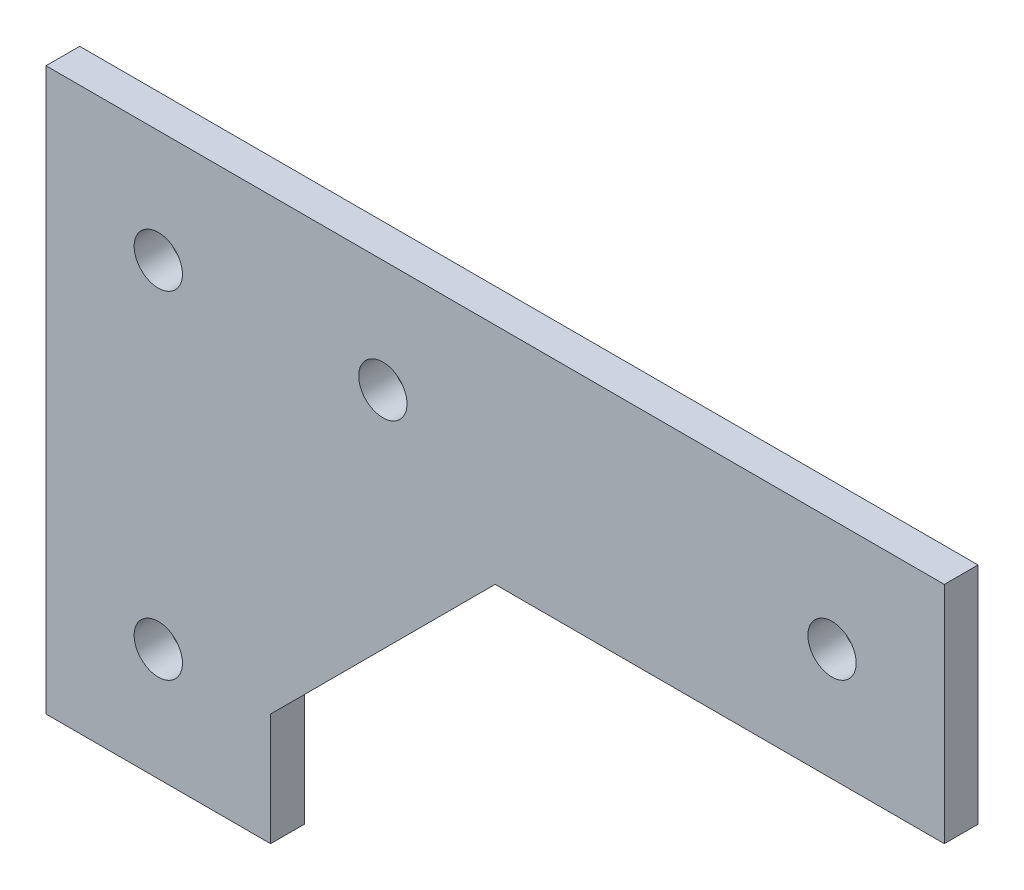
ISO-10303-21;
HEADER;
FILE_DESCRIPTION(('STEP AP214'),'2;1');
FILE_NAME('part.step','',(''),(''),'','','');
FILE_SCHEMA(('AUTOMOTIVE_DESIGN { 1 0 10303 214 1 1 1 1 }'));
ENDSEC;
DATA;
#1=APPLICATION_CONTEXT('core data for automotive mechanical design processes');
#2=APPLICATION_PROTOCOL_DEFINITION('international standard','automotive_design',2000,#1);
#3=PRODUCT_CONTEXT('',#1,'mechanical');
#4=PRODUCT('Part','Part','',(#3));
#5=PRODUCT_RELATED_PRODUCT_CATEGORY('part','',(#4));
#6=PRODUCT_DEFINITION_FORMATION('','',#4);
#7=PRODUCT_DEFINITION_CONTEXT('part definition',#1,'design');
#8=PRODUCT_DEFINITION('design','',#6,#7);
#9=PRODUCT_DEFINITION_SHAPE('','',#8);
#10=(LENGTH_UNIT() NAMED_UNIT(*) SI_UNIT(.MILLI.,.METRE.));
#11=(NAMED_UNIT(*) PLANE_ANGLE_UNIT() SI_UNIT($,.RADIAN.));
#12=(NAMED_UNIT(*) SI_UNIT($,.STERADIAN.) SOLID_ANGLE_UNIT());
#13=UNCERTAINTY_MEASURE_WITH_UNIT(LENGTH_MEASURE(1.E-05),#10,'distance_accuracy_value','');
#14=(GEOMETRIC_REPRESENTATION_CONTEXT(3) GLOBAL_UNCERTAINTY_ASSIGNED_CONTEXT((#13)) GLOBAL_UNIT_ASSIGNED_CONTEXT((#10,
#11,#12)) REPRESENTATION_CONTEXT('',''));
#15=CARTESIAN_POINT('',(0.,0.,0.));
#16=DIRECTION('',(0.,0.,1.));
#17=DIRECTION('',(1.,0.,0.));
#18=AXIS2_PLACEMENT_3D('',#15,#16,#17);
#19=CARTESIAN_POINT('',(0.,0.,3.));
#20=DIRECTION('',(0.,0.,1.));
#21=DIRECTION('',(1.,0.,0.));
#22=AXIS2_PLACEMENT_3D('',#19,#20,#21);
#23=PLANE('',#22);
#24=CARTESIAN_POINT('',(-17.5029517864278,125.,3.));
#25=DIRECTION('',(0.,0.,1.));
#26=DIRECTION('',(1.,0.,0.));
#27=AXIS2_PLACEMENT_3D('',#24,#25,#26);
#28=CIRCLE('',#27,2.15);
#29=CARTESIAN_POINT('',(-15.3529517864278,125.,3.));
#30=VERTEX_POINT('',#29);
#31=EDGE_CURVE('E172',#30,#30,#28,.T.);
#32=ORIENTED_EDGE('',*,*,#31,.F.);
#33=EDGE_LOOP('',(#32));
#34=FACE_BOUND('',#33,.T.);
#35=CARTESIAN_POINT('',(2.49704821357221,155.,3.));
#36=DIRECTION('',(0.,0.,1.));
#37=DIRECTION('',(1.,0.,0.));
#38=AXIS2_PLACEMENT_3D('',#35,#36,#37);
#39=CIRCLE('',#38,2.15000000000001);
#40=CARTESIAN_POINT('',(4.64704821357221,155.,3.));
#41=VERTEX_POINT('',#40);
#42=EDGE_CURVE('E130',#41,#41,#39,.T.);
#43=ORIENTED_EDGE('',*,*,#42,.F.);
#44=EDGE_LOOP('',(#43));
#45=FACE_BOUND('',#44,.T.);
#46=DIRECTION('',(0.,1.,0.));
#47=VECTOR('',#46,1.);
#48=CARTESIAN_POINT('',(52.4970482135722,145.,3.));
#49=LINE('',#48,#47);
#50=CARTESIAN_POINT('',(52.4970482135722,145.,3.));
#51=VERTEX_POINT('',#50);
#52=CARTESIAN_POINT('',(52.4970482135722,165.,3.));
#53=VERTEX_POINT('',#52);
#54=EDGE_CURVE('E139',#51,#53,#49,.T.);
#55=ORIENTED_EDGE('',*,*,#54,.T.);
#56=DIRECTION('',(-1.,0.,0.));
#57=VECTOR('',#56,1.);
#58=CARTESIAN_POINT('',(52.4970482135722,165.,3.));
#59=LINE('',#58,#57);
#60=CARTESIAN_POINT('',(-27.5029517864278,165.,3.));
#61=VERTEX_POINT('',#60);
#62=EDGE_CURVE('E92',#53,#61,#59,.T.);
#63=ORIENTED_EDGE('',*,*,#62,.T.);
#64=DIRECTION('',(0.,-1.,0.));
#65=VECTOR('',#64,1.);
#66=CARTESIAN_POINT('',(-27.5029517864278,165.,3.));
#67=LINE('',#66,#65);
#68=CARTESIAN_POINT('',(-27.5029517864279,115.,3.));
#69=VERTEX_POINT('',#68);
#70=EDGE_CURVE('E151',#61,#69,#67,.T.);
#71=ORIENTED_EDGE('',*,*,#70,.T.);
#72=DIRECTION('',(1.,0.,0.));
#73=VECTOR('',#72,1.);
#74=CARTESIAN_POINT('',(-27.5029517864279,115.,3.));
#75=LINE('',#74,#73);
#76=CARTESIAN_POINT('',(-7.50295178642777,115.,3.));
#77=VERTEX_POINT('',#76);
#78=EDGE_CURVE('E108',#69,#77,#75,.T.);
#79=ORIENTED_EDGE('',*,*,#78,.T.);
#80=DIRECTION('',(0.,1.,0.));
#81=VECTOR('',#80,1.);
#82=CARTESIAN_POINT('',(-7.50295178642777,115.,3.));
#83=LINE('',#82,#81);
#84=CARTESIAN_POINT('',(-7.50295178642779,125.,3.));
#85=VERTEX_POINT('',#84);
#86=EDGE_CURVE('E102',#77,#85,#83,.T.);
#87=ORIENTED_EDGE('',*,*,#86,.T.);
#88=DIRECTION('',(0.707106781186547,0.707106781186548,0.));
#89=VECTOR('',#88,1.);
#90=CARTESIAN_POINT('',(-7.50295178642779,125.,3.));
#91=LINE('',#90,#89);
#92=CARTESIAN_POINT('',(12.4970482135722,145.,3.));
#93=VERTEX_POINT('',#92);
#94=EDGE_CURVE('E106',#85,#93,#91,.T.);
#95=ORIENTED_EDGE('',*,*,#94,.T.);
#96=DIRECTION('',(1.,0.,0.));
#97=VECTOR('',#96,1.);
#98=CARTESIAN_POINT('',(12.4970482135722,145.,3.));
#99=LINE('',#98,#97);
#100=EDGE_CURVE('E52',#93,#51,#99,.T.);
#101=ORIENTED_EDGE('',*,*,#100,.T.);
#102=EDGE_LOOP('',(#55,#63,#71,#79,#87,#95,#101));
#103=FACE_BOUND('',#102,.T.);
#104=CARTESIAN_POINT('',(42.4970482135722,155.,3.));
#105=DIRECTION('',(0.,0.,1.));
#106=DIRECTION('',(1.,0.,0.));
#107=AXIS2_PLACEMENT_3D('',#104,#105,#106);
#108=CIRCLE('',#107,2.15000000000001);
#109=CARTESIAN_POINT('',(44.6470482135722,155.,3.));
#110=VERTEX_POINT('',#109);
#111=EDGE_CURVE('E166',#110,#110,#108,.T.);
#112=ORIENTED_EDGE('',*,*,#111,.F.);
#113=EDGE_LOOP('',(#112));
#114=FACE_BOUND('',#113,.T.);
#115=CARTESIAN_POINT('',(-17.5029517864278,155.,3.));
#116=DIRECTION('',(0.,0.,1.));
#117=DIRECTION('',(1.,0.,0.));
#118=AXIS2_PLACEMENT_3D('',#115,#116,#117);
#119=CIRCLE('',#118,2.15);
#120=CARTESIAN_POINT('',(-15.3529517864278,155.,3.));
#121=VERTEX_POINT('',#120);
#122=EDGE_CURVE('E178',#121,#121,#119,.T.);
#123=ORIENTED_EDGE('',*,*,#122,.F.);
#124=EDGE_LOOP('',(#123));
#125=FACE_BOUND('',#124,.T.);
#126=ADVANCED_FACE('F35',(#34,#45,#103,#114,#125),#23,.T.);
#127=CARTESIAN_POINT('',(0.,0.,0.));
#128=DIRECTION('',(0.,0.,1.));
#129=DIRECTION('',(1.,0.,0.));
#130=AXIS2_PLACEMENT_3D('',#127,#128,#129);
#131=PLANE('',#130);
#132=DIRECTION('',(0.,1.,0.));
#133=VECTOR('',#132,1.);
#134=CARTESIAN_POINT('',(52.4970482135722,145.,0.));
#135=LINE('',#134,#133);
#136=CARTESIAN_POINT('',(52.4970482135722,145.,0.));
#137=VERTEX_POINT('',#136);
#138=CARTESIAN_POINT('',(52.4970482135722,165.,0.));
#139=VERTEX_POINT('',#138);
#140=EDGE_CURVE('E126',#137,#139,#135,.T.);
#141=ORIENTED_EDGE('',*,*,#140,.F.);
#142=DIRECTION('',(1.,0.,0.));
#143=VECTOR('',#142,1.);
#144=CARTESIAN_POINT('',(12.4970482135722,145.,0.));
#145=LINE('',#144,#143);
#146=CARTESIAN_POINT('',(12.4970482135722,145.,0.));
#147=VERTEX_POINT('',#146);
#148=EDGE_CURVE('E84',#147,#137,#145,.T.);
#149=ORIENTED_EDGE('',*,*,#148,.F.);
#150=DIRECTION('',(0.707106781186547,0.707106781186548,0.));
#151=VECTOR('',#150,1.);
#152=CARTESIAN_POINT('',(-7.50295178642779,125.,0.));
#153=LINE('',#152,#151);
#154=CARTESIAN_POINT('',(-7.50295178642779,125.,0.));
#155=VERTEX_POINT('',#154);
#156=EDGE_CURVE('E78',#155,#147,#153,.T.);
#157=ORIENTED_EDGE('',*,*,#156,.F.);
#158=DIRECTION('',(0.,1.,0.));
#159=VECTOR('',#158,1.);
#160=CARTESIAN_POINT('',(-7.50295178642777,115.,0.));
#161=LINE('',#160,#159);
#162=CARTESIAN_POINT('',(-7.50295178642777,115.,0.));
#163=VERTEX_POINT('',#162);
#164=EDGE_CURVE('E116',#163,#155,#161,.T.);
#165=ORIENTED_EDGE('',*,*,#164,.F.);
#166=DIRECTION('',(1.,0.,0.));
#167=VECTOR('',#166,1.);
#168=CARTESIAN_POINT('',(-27.5029517864279,115.,0.));
#169=LINE('',#168,#167);
#170=CARTESIAN_POINT('',(-27.5029517864279,115.,0.));
#171=VERTEX_POINT('',#170);
#172=EDGE_CURVE('E134',#171,#163,#169,.T.);
#173=ORIENTED_EDGE('',*,*,#172,.F.);
#174=DIRECTION('',(0.,-1.,0.));
#175=VECTOR('',#174,1.);
#176=CARTESIAN_POINT('',(-27.5029517864278,165.,0.));
#177=LINE('',#176,#175);
#178=CARTESIAN_POINT('',(-27.5029517864278,165.,0.));
#179=VERTEX_POINT('',#178);
#180=EDGE_CURVE('E132',#179,#171,#177,.T.);
#181=ORIENTED_EDGE('',*,*,#180,.F.);
#182=DIRECTION('',(-1.,0.,0.));
#183=VECTOR('',#182,1.);
#184=CARTESIAN_POINT('',(52.4970482135722,165.,0.));
#185=LINE('',#184,#183);
#186=EDGE_CURVE('E129',#139,#179,#185,.T.);
#187=ORIENTED_EDGE('',*,*,#186,.F.);
#188=EDGE_LOOP('',(#141,#149,#157,#165,#173,#181,#187));
#189=FACE_BOUND('',#188,.T.);
#190=CARTESIAN_POINT('',(2.49704821357221,155.,0.));
#191=DIRECTION('',(0.,0.,1.));
#192=DIRECTION('',(1.,0.,0.));
#193=AXIS2_PLACEMENT_3D('',#190,#191,#192);
#194=CIRCLE('',#193,2.15000000000001);
#195=CARTESIAN_POINT('',(4.64704821357221,155.,0.));
#196=VERTEX_POINT('',#195);
#197=EDGE_CURVE('E163',#196,#196,#194,.T.);
#198=ORIENTED_EDGE('',*,*,#197,.T.);
#199=EDGE_LOOP('',(#198));
#200=FACE_BOUND('',#199,.T.);
#201=CARTESIAN_POINT('',(42.4970482135722,155.,0.));
#202=DIRECTION('',(0.,0.,1.));
#203=DIRECTION('',(1.,0.,0.));
#204=AXIS2_PLACEMENT_3D('',#201,#202,#203);
#205=CIRCLE('',#204,2.15000000000001);
#206=CARTESIAN_POINT('',(44.6470482135722,155.,0.));
#207=VERTEX_POINT('',#206);
#208=EDGE_CURVE('E169',#207,#207,#205,.T.);
#209=ORIENTED_EDGE('',*,*,#208,.T.);
#210=EDGE_LOOP('',(#209));
#211=FACE_BOUND('',#210,.T.);
#212=CARTESIAN_POINT('',(-17.5029517864278,125.,0.));
#213=DIRECTION('',(0.,0.,1.));
#214=DIRECTION('',(1.,0.,0.));
#215=AXIS2_PLACEMENT_3D('',#212,#213,#214);
#216=CIRCLE('',#215,2.15);
#217=CARTESIAN_POINT('',(-15.3529517864278,125.,0.));
#218=VERTEX_POINT('',#217);
#219=EDGE_CURVE('E175',#218,#218,#216,.T.);
#220=ORIENTED_EDGE('',*,*,#219,.T.);
#221=EDGE_LOOP('',(#220));
#222=FACE_BOUND('',#221,.T.);
#223=CARTESIAN_POINT('',(-17.5029517864278,155.,0.));
#224=DIRECTION('',(0.,0.,1.));
#225=DIRECTION('',(1.,0.,0.));
#226=AXIS2_PLACEMENT_3D('',#223,#224,#225);
#227=CIRCLE('',#226,2.15);
#228=CARTESIAN_POINT('',(-15.3529517864278,155.,0.));
#229=VERTEX_POINT('',#228);
#230=EDGE_CURVE('E181',#229,#229,#227,.T.);
#231=ORIENTED_EDGE('',*,*,#230,.T.);
#232=EDGE_LOOP('',(#231));
#233=FACE_BOUND('',#232,.T.);
#234=ADVANCED_FACE('F155',(#189,#200,#211,#222,#233),#131,.F.);
#235=CARTESIAN_POINT('',(52.4970482135722,145.,3.));
#236=DIRECTION('',(-1.,0.,0.));
#237=DIRECTION('',(0.,0.,1.));
#238=AXIS2_PLACEMENT_3D('',#235,#236,#237);
#239=PLANE('',#238);
#240=ORIENTED_EDGE('',*,*,#140,.T.);
#241=DIRECTION('',(0.,0.,-1.));
#242=VECTOR('',#241,1.);
#243=CARTESIAN_POINT('',(52.4970482135722,165.,3.));
#244=LINE('',#243,#242);
#245=EDGE_CURVE('E11',#53,#139,#244,.T.);
#246=ORIENTED_EDGE('',*,*,#245,.F.);
#247=ORIENTED_EDGE('',*,*,#54,.F.);
#248=DIRECTION('',(0.,0.,-1.));
#249=VECTOR('',#248,1.);
#250=CARTESIAN_POINT('',(52.4970482135722,145.,3.));
#251=LINE('',#250,#249);
#252=EDGE_CURVE('E122',#51,#137,#251,.T.);
#253=ORIENTED_EDGE('',*,*,#252,.T.);
#254=EDGE_LOOP('',(#240,#246,#247,#253));
#255=FACE_BOUND('',#254,.T.);
#256=ADVANCED_FACE('F37',(#255),#239,.F.);
#257=CARTESIAN_POINT('',(52.4970482135722,165.,3.));
#258=DIRECTION('',(0.,-1.,0.));
#259=DIRECTION('',(0.,0.,-1.));
#260=AXIS2_PLACEMENT_3D('',#257,#258,#259);
#261=PLANE('',#260);
#262=ORIENTED_EDGE('',*,*,#186,.T.);
#263=DIRECTION('',(0.,0.,-1.));
#264=VECTOR('',#263,1.);
#265=CARTESIAN_POINT('',(-27.5029517864278,165.,3.));
#266=LINE('',#265,#264);
#267=EDGE_CURVE('E44',#61,#179,#266,.T.);
#268=ORIENTED_EDGE('',*,*,#267,.F.);
#269=ORIENTED_EDGE('',*,*,#62,.F.);
#270=ORIENTED_EDGE('',*,*,#245,.T.);
#271=EDGE_LOOP('',(#262,#268,#269,#270));
#272=FACE_BOUND('',#271,.T.);
#273=ADVANCED_FACE('F213',(#272),#261,.F.);
#274=CARTESIAN_POINT('',(-27.5029517864278,165.,3.));
#275=DIRECTION('',(1.,0.,0.));
#276=DIRECTION('',(0.,1.,0.));
#277=AXIS2_PLACEMENT_3D('',#274,#275,#276);
#278=PLANE('',#277);
#279=ORIENTED_EDGE('',*,*,#180,.T.);
#280=DIRECTION('',(0.,0.,-1.));
#281=VECTOR('',#280,1.);
#282=CARTESIAN_POINT('',(-27.5029517864279,115.,3.));
#283=LINE('',#282,#281);
#284=EDGE_CURVE('E143',#69,#171,#283,.T.);
#285=ORIENTED_EDGE('',*,*,#284,.F.);
#286=ORIENTED_EDGE('',*,*,#70,.F.);
#287=ORIENTED_EDGE('',*,*,#267,.T.);
#288=EDGE_LOOP('',(#279,#285,#286,#287));
#289=FACE_BOUND('',#288,.T.);
#290=ADVANCED_FACE('F149',(#289),#278,.F.);
#291=CARTESIAN_POINT('',(-27.5029517864279,115.,3.));
#292=DIRECTION('',(0.,1.,0.));
#293=DIRECTION('',(0.,0.,1.));
#294=AXIS2_PLACEMENT_3D('',#291,#292,#293);
#295=PLANE('',#294);
#296=ORIENTED_EDGE('',*,*,#172,.T.);
#297=DIRECTION('',(0.,0.,-1.));
#298=VECTOR('',#297,1.);
#299=CARTESIAN_POINT('',(-7.50295178642777,115.,3.));
#300=LINE('',#299,#298);
#301=EDGE_CURVE('E117',#77,#163,#300,.T.);
#302=ORIENTED_EDGE('',*,*,#301,.F.);
#303=ORIENTED_EDGE('',*,*,#78,.F.);
#304=ORIENTED_EDGE('',*,*,#284,.T.);
#305=EDGE_LOOP('',(#296,#302,#303,#304));
#306=FACE_BOUND('',#305,.T.);
#307=ADVANCED_FACE('F158',(#306),#295,.F.);
#308=CARTESIAN_POINT('',(-7.50295178642777,115.,3.));
#309=DIRECTION('',(-1.,0.,0.));
#310=DIRECTION('',(0.,-1.,0.));
#311=AXIS2_PLACEMENT_3D('',#308,#309,#310);
#312=PLANE('',#311);
#313=ORIENTED_EDGE('',*,*,#164,.T.);
#314=DIRECTION('',(0.,0.,-1.));
#315=VECTOR('',#314,1.);
#316=CARTESIAN_POINT('',(-7.50295178642779,125.,3.));
#317=LINE('',#316,#315);
#318=EDGE_CURVE('E113',#85,#155,#317,.T.);
#319=ORIENTED_EDGE('',*,*,#318,.F.);
#320=ORIENTED_EDGE('',*,*,#86,.F.);
#321=ORIENTED_EDGE('',*,*,#301,.T.);
#322=EDGE_LOOP('',(#313,#319,#320,#321));
#323=FACE_BOUND('',#322,.T.);
#324=ADVANCED_FACE('F114',(#323),#312,.F.);
#325=CARTESIAN_POINT('',(-7.50295178642779,125.,3.));
#326=DIRECTION('',(-0.707106781186548,0.707106781186547,0.));
#327=DIRECTION('',(-0.707106781186547,-0.707106781186548,0.));
#328=AXIS2_PLACEMENT_3D('',#325,#326,#327);
#329=PLANE('',#328);
#330=ORIENTED_EDGE('',*,*,#156,.T.);
#331=DIRECTION('',(0.,0.,-1.));
#332=VECTOR('',#331,1.);
#333=CARTESIAN_POINT('',(12.4970482135722,145.,3.));
#334=LINE('',#333,#332);
#335=EDGE_CURVE('E118',#93,#147,#334,.T.);
#336=ORIENTED_EDGE('',*,*,#335,.F.);
#337=ORIENTED_EDGE('',*,*,#94,.F.);
#338=ORIENTED_EDGE('',*,*,#318,.T.);
#339=EDGE_LOOP('',(#330,#336,#337,#338));
#340=FACE_BOUND('',#339,.T.);
#341=ADVANCED_FACE('F120',(#340),#329,.F.);
#342=CARTESIAN_POINT('',(12.4970482135722,145.,3.));
#343=DIRECTION('',(0.,1.,0.));
#344=DIRECTION('',(0.,0.,1.));
#345=AXIS2_PLACEMENT_3D('',#342,#343,#344);
#346=PLANE('',#345);
#347=ORIENTED_EDGE('',*,*,#148,.T.);
#348=ORIENTED_EDGE('',*,*,#252,.F.);
#349=ORIENTED_EDGE('',*,*,#100,.F.);
#350=ORIENTED_EDGE('',*,*,#335,.T.);
#351=EDGE_LOOP('',(#347,#348,#349,#350));
#352=FACE_BOUND('',#351,.T.);
#353=ADVANCED_FACE('F203',(#352),#346,.F.);
#354=CARTESIAN_POINT('',(2.49704821357221,155.,3.));
#355=DIRECTION('',(0.,0.,-1.));
#356=DIRECTION('',(-1.,0.,0.));
#357=AXIS2_PLACEMENT_3D('',#354,#355,#356);
#358=CYLINDRICAL_SURFACE('',#357,2.15000000000001);
#359=ORIENTED_EDGE('',*,*,#42,.T.);
#360=EDGE_LOOP('',(#359));
#361=FACE_BOUND('',#360,.T.);
#362=ORIENTED_EDGE('',*,*,#197,.F.);
#363=EDGE_LOOP('',(#362));
#364=FACE_BOUND('',#363,.T.);
#365=ADVANCED_FACE('F200',(#361,#364),#358,.F.);
#366=CARTESIAN_POINT('',(42.4970482135722,155.,3.));
#367=DIRECTION('',(0.,0.,-1.));
#368=DIRECTION('',(-1.,0.,0.));
#369=AXIS2_PLACEMENT_3D('',#366,#367,#368);
#370=CYLINDRICAL_SURFACE('',#369,2.15000000000001);
#371=ORIENTED_EDGE('',*,*,#111,.T.);
#372=EDGE_LOOP('',(#371));
#373=FACE_BOUND('',#372,.T.);
#374=ORIENTED_EDGE('',*,*,#208,.F.);
#375=EDGE_LOOP('',(#374));
#376=FACE_BOUND('',#375,.T.);
#377=ADVANCED_FACE('F272',(#373,#376),#370,.F.);
#378=CARTESIAN_POINT('',(-17.5029517864278,125.,3.));
#379=DIRECTION('',(0.,0.,-1.));
#380=DIRECTION('',(-1.,0.,0.));
#381=AXIS2_PLACEMENT_3D('',#378,#379,#380);
#382=CYLINDRICAL_SURFACE('',#381,2.15);
#383=ORIENTED_EDGE('',*,*,#31,.T.);
#384=EDGE_LOOP('',(#383));
#385=FACE_BOUND('',#384,.T.);
#386=ORIENTED_EDGE('',*,*,#219,.F.);
#387=EDGE_LOOP('',(#386));
#388=FACE_BOUND('',#387,.T.);
#389=ADVANCED_FACE('F280',(#385,#388),#382,.F.);
#390=CARTESIAN_POINT('',(-17.5029517864278,155.,3.));
#391=DIRECTION('',(0.,0.,-1.));
#392=DIRECTION('',(-1.,0.,0.));
#393=AXIS2_PLACEMENT_3D('',#390,#391,#392);
#394=CYLINDRICAL_SURFACE('',#393,2.15);
#395=ORIENTED_EDGE('',*,*,#122,.T.);
#396=EDGE_LOOP('',(#395));
#397=FACE_BOUND('',#396,.T.);
#398=ORIENTED_EDGE('',*,*,#230,.F.);
#399=EDGE_LOOP('',(#398));
#400=FACE_BOUND('',#399,.T.);
#401=ADVANCED_FACE('F187',(#397,#400),#394,.F.);
#402=CLOSED_SHELL('',(#126,#234,#256,#273,#290,#307,#324,#341,#353,#365,#377,#389,#401));
#403=MANIFOLD_SOLID_BREP('B2',#402);
#404=ADVANCED_BREP_SHAPE_REPRESENTATION('',(#18,#403),#14);
#405=SHAPE_DEFINITION_REPRESENTATION(#9,#404);
ENDSEC;
END-ISO-10303-21;
